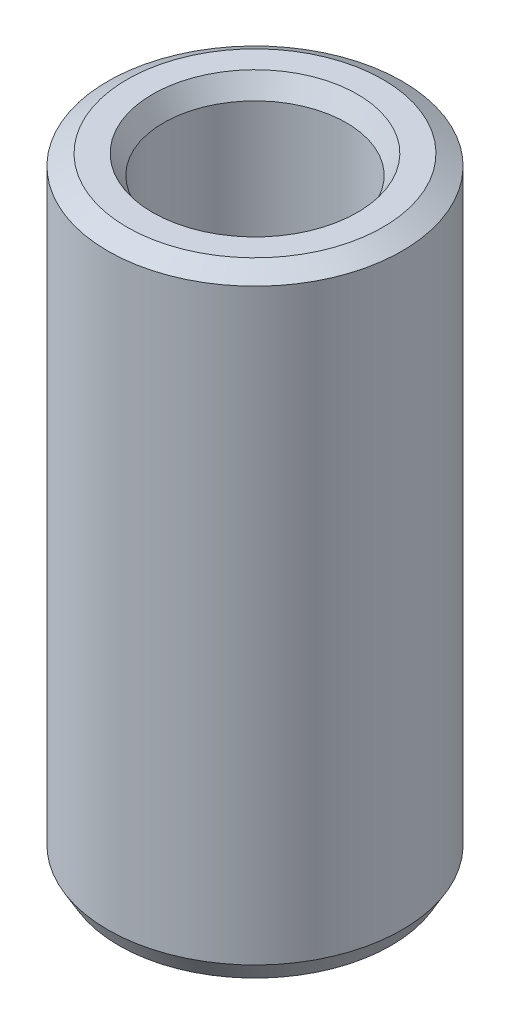
ISO-10303-21;
HEADER;
FILE_DESCRIPTION(('STEP AP214'),'2;1');
FILE_NAME('part.step','',(''),(''),'','','');
FILE_SCHEMA(('AUTOMOTIVE_DESIGN { 1 0 10303 214 1 1 1 1 }'));
ENDSEC;
DATA;
#1=APPLICATION_CONTEXT('core data for automotive mechanical design processes');
#2=APPLICATION_PROTOCOL_DEFINITION('international standard','automotive_design',2000,#1);
#3=PRODUCT_CONTEXT('',#1,'mechanical');
#4=PRODUCT('Part','Part','',(#3));
#5=PRODUCT_RELATED_PRODUCT_CATEGORY('part','',(#4));
#6=PRODUCT_DEFINITION_FORMATION('','',#4);
#7=PRODUCT_DEFINITION_CONTEXT('part definition',#1,'design');
#8=PRODUCT_DEFINITION('design','',#6,#7);
#9=PRODUCT_DEFINITION_SHAPE('','',#8);
#10=(LENGTH_UNIT() NAMED_UNIT(*) SI_UNIT(.MILLI.,.METRE.));
#11=(NAMED_UNIT(*) PLANE_ANGLE_UNIT() SI_UNIT($,.RADIAN.));
#12=(NAMED_UNIT(*) SI_UNIT($,.STERADIAN.) SOLID_ANGLE_UNIT());
#13=UNCERTAINTY_MEASURE_WITH_UNIT(LENGTH_MEASURE(1.E-05),#10,'distance_accuracy_value','');
#14=(GEOMETRIC_REPRESENTATION_CONTEXT(3) GLOBAL_UNCERTAINTY_ASSIGNED_CONTEXT((#13)) GLOBAL_UNIT_ASSIGNED_CONTEXT((#10,
#11,#12)) REPRESENTATION_CONTEXT('',''));
#15=CARTESIAN_POINT('',(0.,0.,0.));
#16=DIRECTION('',(0.,0.,1.));
#17=DIRECTION('',(1.,0.,0.));
#18=AXIS2_PLACEMENT_3D('',#15,#16,#17);
#19=CARTESIAN_POINT('',(0.,126.014681249843,0.));
#20=DIRECTION('',(0.,-1.,0.));
#21=DIRECTION('',(0.,0.,-1.));
#22=AXIS2_PLACEMENT_3D('',#19,#20,#21);
#23=CYLINDRICAL_SURFACE('',#22,30.);
#24=CARTESIAN_POINT('',(0.,3.90621969390365,0.));
#25=DIRECTION('',(0.,1.,0.));
#26=DIRECTION('',(0.,0.,1.));
#27=AXIS2_PLACEMENT_3D('',#24,#25,#26);
#28=CIRCLE('',#27,30.);
#29=CARTESIAN_POINT('',(0.,3.90621969390364,30.));
#30=VERTEX_POINT('',#29);
#31=EDGE_CURVE('E10',#30,#30,#28,.T.);
#32=ORIENTED_EDGE('',*,*,#31,.T.);
#33=EDGE_LOOP('',(#32));
#34=FACE_BOUND('',#33,.T.);
#35=CARTESIAN_POINT('',(0.,123.759424258054,0.));
#36=DIRECTION('',(0.,1.,0.));
#37=DIRECTION('',(0.,0.,1.));
#38=AXIS2_PLACEMENT_3D('',#35,#36,#37);
#39=CIRCLE('',#38,30.);
#40=CARTESIAN_POINT('',(0.,123.759424258054,30.));
#41=VERTEX_POINT('',#40);
#42=EDGE_CURVE('E50',#41,#41,#39,.F.);
#43=ORIENTED_EDGE('',*,*,#42,.T.);
#44=EDGE_LOOP('',(#43));
#45=FACE_BOUND('',#44,.T.);
#46=ADVANCED_FACE('F39',(#34,#45),#23,.T.);
#47=CARTESIAN_POINT('',(0.,126.014681249843,0.));
#48=DIRECTION('',(0.,1.,0.));
#49=DIRECTION('',(0.,0.,1.));
#50=AXIS2_PLACEMENT_3D('',#47,#48,#49);
#51=PLANE('',#50);
#52=CARTESIAN_POINT('',(0.,126.014681249843,0.));
#53=DIRECTION('',(0.,1.,0.));
#54=DIRECTION('',(0.,0.,1.));
#55=AXIS2_PLACEMENT_3D('',#52,#53,#54);
#56=CIRCLE('',#55,20.8852581694194);
#57=CARTESIAN_POINT('',(0.,126.014681249843,20.8852581694194));
#58=VERTEX_POINT('',#57);
#59=EDGE_CURVE('E58',#58,#58,#56,.F.);
#60=ORIENTED_EDGE('',*,*,#59,.T.);
#61=EDGE_LOOP('',(#60));
#62=FACE_BOUND('',#61,.T.);
#63=CARTESIAN_POINT('',(0.,126.014681249843,0.));
#64=DIRECTION('',(0.,1.,0.));
#65=DIRECTION('',(0.,0.,1.));
#66=AXIS2_PLACEMENT_3D('',#63,#64,#65);
#67=CIRCLE('',#66,26.0937803060964);
#68=CARTESIAN_POINT('',(0.,126.014681249843,26.0937803060964));
#69=VERTEX_POINT('',#68);
#70=EDGE_CURVE('E61',#69,#69,#67,.T.);
#71=ORIENTED_EDGE('',*,*,#70,.T.);
#72=EDGE_LOOP('',(#71));
#73=FACE_BOUND('',#72,.T.);
#74=ADVANCED_FACE('F88',(#62,#73),#51,.T.);
#75=CARTESIAN_POINT('',(0.,0.,0.));
#76=DIRECTION('',(0.,1.,0.));
#77=DIRECTION('',(0.,0.,1.));
#78=AXIS2_PLACEMENT_3D('',#75,#76,#77);
#79=PLANE('',#78);
#80=CARTESIAN_POINT('',(0.,0.,0.));
#81=DIRECTION('',(0.,1.,0.));
#82=DIRECTION('',(0.,0.,1.));
#83=AXIS2_PLACEMENT_3D('',#80,#81,#82);
#84=CIRCLE('',#83,22.536220871534);
#85=CARTESIAN_POINT('',(0.,0.,22.536220871534));
#86=VERTEX_POINT('',#85);
#87=EDGE_CURVE('E51',#86,#86,#84,.T.);
#88=ORIENTED_EDGE('',*,*,#87,.T.);
#89=EDGE_LOOP('',(#88));
#90=FACE_BOUND('',#89,.T.);
#91=CARTESIAN_POINT('',(0.,0.,0.));
#92=DIRECTION('',(0.,1.,0.));
#93=DIRECTION('',(0.,0.,1.));
#94=AXIS2_PLACEMENT_3D('',#91,#92,#93);
#95=CIRCLE('',#94,27.7447430082109);
#96=CARTESIAN_POINT('',(0.,0.,27.7447430082109));
#97=VERTEX_POINT('',#96);
#98=EDGE_CURVE('E54',#97,#97,#95,.F.);
#99=ORIENTED_EDGE('',*,*,#98,.T.);
#100=EDGE_LOOP('',(#99));
#101=FACE_BOUND('',#100,.T.);
#102=ADVANCED_FACE('F83',(#90,#101),#79,.F.);
#103=CARTESIAN_POINT('',(0.,126.014681249843,0.));
#104=DIRECTION('',(0.,-1.,0.));
#105=DIRECTION('',(0.,0.,-1.));
#106=AXIS2_PLACEMENT_3D('',#103,#104,#105);
#107=CYLINDRICAL_SURFACE('',#106,18.6300011776303);
#108=CARTESIAN_POINT('',(0.,122.10846155594,0.));
#109=DIRECTION('',(0.,1.,0.));
#110=DIRECTION('',(0.,0.,1.));
#111=AXIS2_PLACEMENT_3D('',#108,#109,#110);
#112=CIRCLE('',#111,18.6300011776303);
#113=CARTESIAN_POINT('',(0.,122.10846155594,18.6300011776303));
#114=VERTEX_POINT('',#113);
#115=EDGE_CURVE('E67',#114,#114,#112,.T.);
#116=ORIENTED_EDGE('',*,*,#115,.T.);
#117=EDGE_LOOP('',(#116));
#118=FACE_BOUND('',#117,.T.);
#119=CARTESIAN_POINT('',(0.,2.25525699178911,0.));
#120=DIRECTION('',(0.,1.,0.));
#121=DIRECTION('',(0.,0.,1.));
#122=AXIS2_PLACEMENT_3D('',#119,#120,#121);
#123=CIRCLE('',#122,18.6300011776303);
#124=CARTESIAN_POINT('',(0.,2.25525699178911,18.6300011776303));
#125=VERTEX_POINT('',#124);
#126=EDGE_CURVE('E69',#125,#125,#123,.F.);
#127=ORIENTED_EDGE('',*,*,#126,.T.);
#128=EDGE_LOOP('',(#127));
#129=FACE_BOUND('',#128,.T.);
#130=ADVANCED_FACE('F71',(#118,#129),#107,.F.);
#131=CARTESIAN_POINT('',(0.,122.10846155594,0.));
#132=DIRECTION('',(0.,1.,0.));
#133=DIRECTION('',(0.,0.,1.));
#134=AXIS2_PLACEMENT_3D('',#131,#132,#133);
#135=CONICAL_SURFACE('',#134,18.6300011776303,0.523598775598301);
#136=CARTESIAN_POINT('',(0.,126.014681249843,20.8852581694194));
#137=CARTESIAN_POINT('',(0.,125.973991461365,20.8617659090883));
#138=CARTESIAN_POINT('',(0.,125.933301672887,20.8382736487571));
#139=CARTESIAN_POINT('',(0.,125.851922095931,20.7912891280949));
#140=CARTESIAN_POINT('',(0.,125.811232307452,20.7677968677637));
#141=CARTESIAN_POINT('',(0.,125.729852730496,20.7208123471015));
#142=CARTESIAN_POINT('',(0.,125.689162942018,20.6973200867703));
#143=CARTESIAN_POINT('',(0.,125.607783365062,20.650335566108));
#144=CARTESIAN_POINT('',(0.,125.567093576583,20.6268433057769));
#145=CARTESIAN_POINT('',(0.,125.485713999627,20.5798587851146));
#146=CARTESIAN_POINT('',(0.,125.445024211149,20.5563665247835));
#147=CARTESIAN_POINT('',(0.,125.363644634193,20.5093820041212));
#148=CARTESIAN_POINT('',(0.,125.322954845715,20.4858897437901));
#149=CARTESIAN_POINT('',(0.,125.241575268758,20.4389052231278));
#150=CARTESIAN_POINT('',(0.,125.20088548028,20.4154129627967));
#151=CARTESIAN_POINT('',(0.,125.119505903324,20.3684284421344));
#152=CARTESIAN_POINT('',(0.,125.078816114846,20.3449361818033));
#153=CARTESIAN_POINT('',(0.,124.997436537889,20.297951661141));
#154=CARTESIAN_POINT('',(0.,124.956746749411,20.2744594008099));
#155=CARTESIAN_POINT('',(0.,124.875367172455,20.2274748801476));
#156=CARTESIAN_POINT('',(0.,124.834677383977,20.2039826198165));
#157=CARTESIAN_POINT('',(0.,124.75329780702,20.1569980991542));
#158=CARTESIAN_POINT('',(0.,124.712608018542,20.133505838823));
#159=CARTESIAN_POINT('',(0.,124.631228441586,20.0865213181608));
#160=CARTESIAN_POINT('',(0.,124.590538653108,20.0630290578296));
#161=CARTESIAN_POINT('',(0.,124.509159076151,20.0160445371674));
#162=CARTESIAN_POINT('',(0.,124.468469287673,19.9925522768362));
#163=CARTESIAN_POINT('',(0.,124.387089710717,19.945567756174));
#164=CARTESIAN_POINT('',(0.,124.346399922239,19.9220754958428));
#165=CARTESIAN_POINT('',(0.,124.265020345282,19.8750909751805));
#166=CARTESIAN_POINT('',(0.,124.224330556804,19.8515987148494));
#167=CARTESIAN_POINT('',(0.,124.142950979848,19.8046141941871));
#168=CARTESIAN_POINT('',(0.,124.10226119137,19.781121933856));
#169=CARTESIAN_POINT('',(0.,124.020881614413,19.7341374131937));
#170=CARTESIAN_POINT('',(0.,123.980191825935,19.7106451528626));
#171=CARTESIAN_POINT('',(0.,123.898812248979,19.6636606322003));
#172=CARTESIAN_POINT('',(0.,123.858122460501,19.6401683718692));
#173=CARTESIAN_POINT('',(0.,123.776742883544,19.5931838512069));
#174=CARTESIAN_POINT('',(0.,123.736053095066,19.5696915908758));
#175=CARTESIAN_POINT('',(0.,123.65467351811,19.5227070702135));
#176=CARTESIAN_POINT('',(0.,123.613983729632,19.4992148098824));
#177=CARTESIAN_POINT('',(0.,123.532604152675,19.4522302892201));
#178=CARTESIAN_POINT('',(0.,123.491914364197,19.428738028889));
#179=CARTESIAN_POINT('',(0.,123.410534787241,19.3817535082267));
#180=CARTESIAN_POINT('',(0.,123.369844998763,19.3582612478956));
#181=CARTESIAN_POINT('',(0.,123.288465421806,19.3112767272333));
#182=CARTESIAN_POINT('',(0.,123.247775633328,19.2877844669021));
#183=CARTESIAN_POINT('',(0.,123.166396056372,19.2407999462399));
#184=CARTESIAN_POINT('',(0.,123.125706267894,19.2173076859087));
#185=CARTESIAN_POINT('',(0.,123.044326690937,19.1703231652465));
#186=CARTESIAN_POINT('',(0.,123.003636902459,19.1468309049153));
#187=CARTESIAN_POINT('',(0.,122.922257325503,19.0998463842531));
#188=CARTESIAN_POINT('',(0.,122.881567537025,19.0763541239219));
#189=CARTESIAN_POINT('',(0.,122.800187960068,19.0293696032596));
#190=CARTESIAN_POINT('',(0.,122.75949817159,19.0058773429285));
#191=CARTESIAN_POINT('',(0.,122.678118594634,18.9588928222662));
#192=CARTESIAN_POINT('',(0.,122.637428806156,18.9354005619351));
#193=CARTESIAN_POINT('',(0.,122.556049229199,18.8884160412728));
#194=CARTESIAN_POINT('',(0.,122.515359440721,18.8649237809417));
#195=CARTESIAN_POINT('',(0.,122.433979863765,18.8179392602794));
#196=CARTESIAN_POINT('',(0.,122.393290075287,18.7944469999483));
#197=CARTESIAN_POINT('',(0.,122.31191049833,18.747462479286));
#198=CARTESIAN_POINT('',(0.,122.271220709852,18.7239702189549));
#199=CARTESIAN_POINT('',(0.,122.189841132896,18.6769856982926));
#200=CARTESIAN_POINT('',(0.,122.149151344418,18.6534934379615));
#201=CARTESIAN_POINT('',(0.,122.10846155594,18.6300011776303));
#202=B_SPLINE_CURVE_WITH_KNOTS('',3,(#136,#137,#138,#139,#140,#141,#142,#143,#144,#145,#146,
#147,#148,#149,#150,#151,#152,#153,#154,#155,#156,#157,#158,#159,#160,#161,#162,#163,#164,#165,
#166,#167,#168,#169,#170,#171,#172,#173,#174,#175,#176,#177,#178,#179,#180,#181,#182,#183,#184,
#185,#186,#187,#188,#189,#190,#191,#192,#193,#194,#195,#196,#197,#198,#199,#200,#201),
.UNSPECIFIED.,.F.,.F.,(4,2,2,2,2,2,2,2,2,2,2,2,2,2,2,2,2,2,2,2,2,2,2,2,2,2,2,2,2,2,2,2,4),(0.,
0.140953561986819,0.281907123973639,0.422860685960458,0.563814247947277,0.704767809934097,
0.845721371920916,0.986674933907735,1.12762849589455,1.26858205788136,1.40953561986818,
1.550489181855,1.69144274384182,1.83239630582863,1.97334986781545,2.11430342980227,
2.25525699178908,2.3962105537759,2.53716411576271,2.67811767774953,2.81907123973635,
2.96002480172317,3.10097836370999,3.2419319256968,3.38288548768361,3.52383904967043,
3.66479261165725,3.80574617364407,3.94669973563088,4.0876532976177,4.22860685960452,
4.36956042159134,4.51051398357814),.UNSPECIFIED.);
#203=EDGE_CURVE('BSEAM77',#58,#114,#202,.T.);
#204=ORIENTED_EDGE('',*,*,#59,.F.);
#205=ORIENTED_EDGE('',*,*,#115,.F.);
#206=ORIENTED_EDGE('',*,*,#203,.T.);
#207=ORIENTED_EDGE('',*,*,#203,.F.);
#208=EDGE_LOOP('',(#204,#206,#205,#207));
#209=FACE_BOUND('',#208,.T.);
#210=ADVANCED_FACE('F77',(#209),#135,.F.);
#211=CARTESIAN_POINT('',(0.,0.,0.));
#212=DIRECTION('',(0.,-1.,0.));
#213=DIRECTION('',(0.,0.,-1.));
#214=AXIS2_PLACEMENT_3D('',#211,#212,#213);
#215=CONICAL_SURFACE('',#214,22.536220871534,1.0471975511966);
#216=ORIENTED_EDGE('',*,*,#126,.F.);
#217=EDGE_LOOP('',(#216));
#218=FACE_BOUND('',#217,.T.);
#219=ORIENTED_EDGE('',*,*,#87,.F.);
#220=EDGE_LOOP('',(#219));
#221=FACE_BOUND('',#220,.T.);
#222=ADVANCED_FACE('F73',(#218,#221),#215,.F.);
#223=CARTESIAN_POINT('',(0.,3.90621969390365,0.));
#224=DIRECTION('',(0.,1.,0.));
#225=DIRECTION('',(0.,0.,1.));
#226=AXIS2_PLACEMENT_3D('',#223,#224,#225);
#227=CONICAL_SURFACE('',#226,30.,0.523598775598304);
#228=CARTESIAN_POINT('',(0.,0.,27.7447430082109));
#229=CARTESIAN_POINT('',(0.,0.0406897884781622,27.768235268542));
#230=CARTESIAN_POINT('',(0.,0.0813795769563253,27.7917275288732));
#231=CARTESIAN_POINT('',(0.,0.162759153912652,27.8387120495354));
#232=CARTESIAN_POINT('',(0.,0.203448942390815,27.8622043098666));
#233=CARTESIAN_POINT('',(0.,0.284828519347141,27.9091888305288));
#234=CARTESIAN_POINT('',(0.,0.325518307825303,27.93268109086));
#235=CARTESIAN_POINT('',(0.,0.406897884781629,27.9796656115223));
#236=CARTESIAN_POINT('',(0.,0.447587673259792,28.0031578718534));
#237=CARTESIAN_POINT('',(0.,0.528967250216118,28.0501423925157));
#238=CARTESIAN_POINT('',(0.,0.569657038694282,28.0736346528468));
#239=CARTESIAN_POINT('',(0.,0.651036615650607,28.1206191735091));
#240=CARTESIAN_POINT('',(0.,0.69172640412877,28.1441114338402));
#241=CARTESIAN_POINT('',(0.,0.773105981085096,28.1910959545025));
#242=CARTESIAN_POINT('',(0.,0.813795769563259,28.2145882148336));
#243=CARTESIAN_POINT('',(0.,0.895175346519585,28.2615727354959));
#244=CARTESIAN_POINT('',(0.,0.935865134997748,28.285064995827));
#245=CARTESIAN_POINT('',(0.,1.01724471195407,28.3320495164893));
#246=CARTESIAN_POINT('',(0.,1.05793450043224,28.3555417768204));
#247=CARTESIAN_POINT('',(0.,1.13931407738856,28.4025262974827));
#248=CARTESIAN_POINT('',(0.,1.18000386586673,28.4260185578138));
#249=CARTESIAN_POINT('',(0.,1.26138344282305,28.4730030784761));
#250=CARTESIAN_POINT('',(0.,1.30207323130122,28.4964953388073));
#251=CARTESIAN_POINT('',(0.,1.38345280825754,28.5434798594695));
#252=CARTESIAN_POINT('',(0.,1.4241425967357,28.5669721198007));
#253=CARTESIAN_POINT('',(0.,1.50552217369203,28.6139566404629));
#254=CARTESIAN_POINT('',(0.,1.54621196217019,28.6374489007941));
#255=CARTESIAN_POINT('',(0.,1.62759153912652,28.6844334214563));
#256=CARTESIAN_POINT('',(0.,1.66828132760468,28.7079256817875));
#257=CARTESIAN_POINT('',(0.,1.74966090456101,28.7549102024498));
#258=CARTESIAN_POINT('',(0.,1.79035069303917,28.7784024627809));
#259=CARTESIAN_POINT('',(0.,1.8717302699955,28.8253869834432));
#260=CARTESIAN_POINT('',(0.,1.91242005847366,28.8488792437743));
#261=CARTESIAN_POINT('',(0.,1.99379963542999,28.8958637644366));
#262=CARTESIAN_POINT('',(0.,2.03448942390815,28.9193560247677));
#263=CARTESIAN_POINT('',(0.,2.11586900086447,28.96634054543));
#264=CARTESIAN_POINT('',(0.,2.15655878934264,28.9898328057611));
#265=CARTESIAN_POINT('',(0.,2.23793836629896,29.0368173264234));
#266=CARTESIAN_POINT('',(0.,2.27862815477713,29.0603095867545));
#267=CARTESIAN_POINT('',(0.,2.36000773173345,29.1072941074168));
#268=CARTESIAN_POINT('',(0.,2.40069752021162,29.1307863677479));
#269=CARTESIAN_POINT('',(0.,2.48207709716794,29.1777708884102));
#270=CARTESIAN_POINT('',(0.,2.5227668856461,29.2012631487414));
#271=CARTESIAN_POINT('',(0.,2.60414646260243,29.2482476694036));
#272=CARTESIAN_POINT('',(0.,2.64483625108059,29.2717399297348));
#273=CARTESIAN_POINT('',(0.,2.72621582803692,29.318724450397));
#274=CARTESIAN_POINT('',(0.,2.76690561651508,29.3422167107282));
#275=CARTESIAN_POINT('',(0.,2.84828519347141,29.3892012313904));
#276=CARTESIAN_POINT('',(0.,2.88897498194957,29.4126934917216));
#277=CARTESIAN_POINT('',(0.,2.9703545589059,29.4596780123839));
#278=CARTESIAN_POINT('',(0.,3.01104434738406,29.483170272715));
#279=CARTESIAN_POINT('',(0.,3.09242392434038,29.5301547933773));
#280=CARTESIAN_POINT('',(0.,3.13311371281855,29.5536470537084));
#281=CARTESIAN_POINT('',(0.,3.21449328977487,29.6006315743707));
#282=CARTESIAN_POINT('',(0.,3.25518307825304,29.6241238347018));
#283=CARTESIAN_POINT('',(0.,3.33656265520936,29.6711083553641));
#284=CARTESIAN_POINT('',(0.,3.37725244368753,29.6946006156952));
#285=CARTESIAN_POINT('',(0.,3.45863202064385,29.7415851363575));
#286=CARTESIAN_POINT('',(0.,3.49932180912202,29.7650773966886));
#287=CARTESIAN_POINT('',(0.,3.58070138607834,29.8120619173509));
#288=CARTESIAN_POINT('',(0.,3.6213911745565,29.835554177682));
#289=CARTESIAN_POINT('',(0.,3.70277075151283,29.8825386983443));
#290=CARTESIAN_POINT('',(0.,3.74346053999099,29.9060309586755));
#291=CARTESIAN_POINT('',(0.,3.82484011694732,29.9530154793377));
#292=CARTESIAN_POINT('',(0.,3.86552990542548,29.9765077396689));
#293=CARTESIAN_POINT('',(0.,3.90621969390364,30.));
#294=B_SPLINE_CURVE_WITH_KNOTS('',3,(#228,#229,#230,#231,#232,#233,#234,#235,#236,#237,#238,
#239,#240,#241,#242,#243,#244,#245,#246,#247,#248,#249,#250,#251,#252,#253,#254,#255,#256,#257,
#258,#259,#260,#261,#262,#263,#264,#265,#266,#267,#268,#269,#270,#271,#272,#273,#274,#275,#276,
#277,#278,#279,#280,#281,#282,#283,#284,#285,#286,#287,#288,#289,#290,#291,#292,#293),
.UNSPECIFIED.,.F.,.F.,(4,2,2,2,2,2,2,2,2,2,2,2,2,2,2,2,2,2,2,2,2,2,2,2,2,2,2,2,2,2,2,2,4),(0.,
0.140953561986818,0.281907123973636,0.422860685960455,0.563814247947273,0.704767809934091,
0.84572137192091,0.986674933907728,1.12762849589455,1.26858205788137,1.40953561986818,
1.550489181855,1.69144274384182,1.83239630582864,1.97334986781546,2.11430342980228,
2.25525699178909,2.39621055377591,2.53716411576273,2.67811767774955,2.81907123973637,
2.96002480172318,3.10097836371,3.24193192569682,3.38288548768364,3.52383904967046,
3.66479261165728,3.8057461736441,3.94669973563091,4.08765329761773,4.22860685960455,
4.36956042159137,4.51051398357819),.UNSPECIFIED.);
#295=EDGE_CURVE('BSEAM76',#97,#30,#294,.T.);
#296=ORIENTED_EDGE('',*,*,#98,.F.);
#297=ORIENTED_EDGE('',*,*,#31,.F.);
#298=ORIENTED_EDGE('',*,*,#295,.T.);
#299=ORIENTED_EDGE('',*,*,#295,.F.);
#300=EDGE_LOOP('',(#296,#298,#297,#299));
#301=FACE_BOUND('',#300,.T.);
#302=ADVANCED_FACE('F76',(#301),#227,.T.);
#303=CARTESIAN_POINT('',(0.,126.014681249843,0.));
#304=DIRECTION('',(0.,-1.,0.));
#305=DIRECTION('',(0.,0.,-1.));
#306=AXIS2_PLACEMENT_3D('',#303,#304,#305);
#307=CONICAL_SURFACE('',#306,26.0937803060964,1.0471975511966);
#308=ORIENTED_EDGE('',*,*,#42,.F.);
#309=EDGE_LOOP('',(#308));
#310=FACE_BOUND('',#309,.T.);
#311=ORIENTED_EDGE('',*,*,#70,.F.);
#312=EDGE_LOOP('',(#311));
#313=FACE_BOUND('',#312,.T.);
#314=ADVANCED_FACE('F45',(#310,#313),#307,.T.);
#315=CLOSED_SHELL('',(#46,#74,#102,#130,#210,#222,#302,#314));
#316=MANIFOLD_SOLID_BREP('B2',#315);
#317=ADVANCED_BREP_SHAPE_REPRESENTATION('',(#18,#316),#14);
#318=SHAPE_DEFINITION_REPRESENTATION(#9,#317);
ENDSEC;
END-ISO-10303-21;
